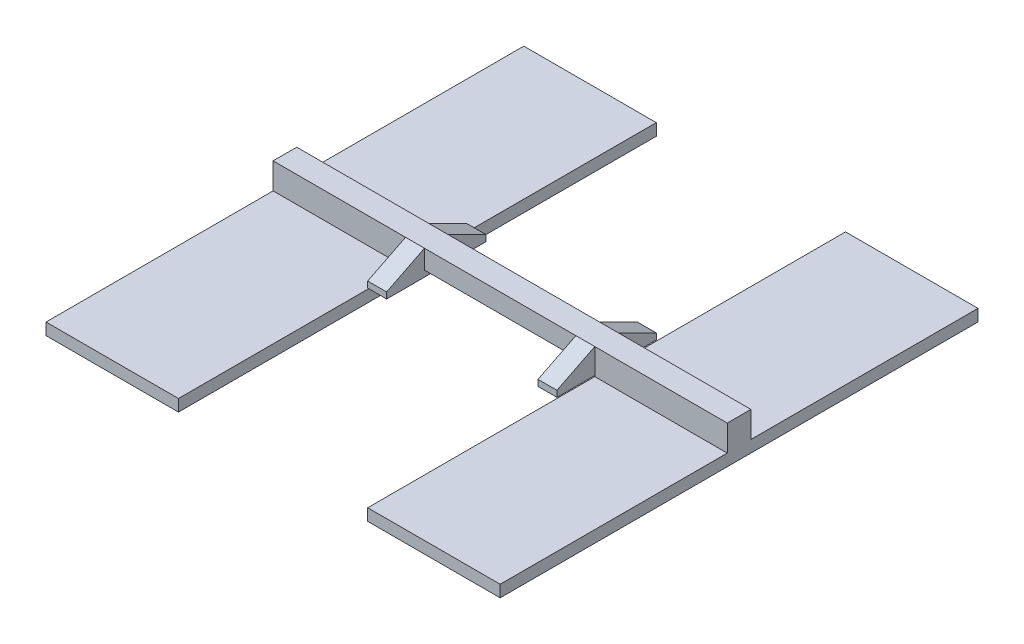
ISO-10303-21;
HEADER;
FILE_DESCRIPTION(('STEP AP214'),'2;1');
FILE_NAME('part.step','',(''),(''),'','','');
FILE_SCHEMA(('AUTOMOTIVE_DESIGN { 1 0 10303 214 1 1 1 1 }'));
ENDSEC;
DATA;
#1=APPLICATION_CONTEXT('core data for automotive mechanical design processes');
#2=APPLICATION_PROTOCOL_DEFINITION('international standard','automotive_design',2000,#1);
#3=PRODUCT_CONTEXT('',#1,'mechanical');
#4=PRODUCT('Part','Part','',(#3));
#5=PRODUCT_RELATED_PRODUCT_CATEGORY('part','',(#4));
#6=PRODUCT_DEFINITION_FORMATION('','',#4);
#7=PRODUCT_DEFINITION_CONTEXT('part definition',#1,'design');
#8=PRODUCT_DEFINITION('design','',#6,#7);
#9=PRODUCT_DEFINITION_SHAPE('','',#8);
#10=(LENGTH_UNIT() NAMED_UNIT(*) SI_UNIT(.MILLI.,.METRE.));
#11=(NAMED_UNIT(*) PLANE_ANGLE_UNIT() SI_UNIT($,.RADIAN.));
#12=(NAMED_UNIT(*) SI_UNIT($,.STERADIAN.) SOLID_ANGLE_UNIT());
#13=UNCERTAINTY_MEASURE_WITH_UNIT(LENGTH_MEASURE(1.E-05),#10,'distance_accuracy_value','');
#14=(GEOMETRIC_REPRESENTATION_CONTEXT(3) GLOBAL_UNCERTAINTY_ASSIGNED_CONTEXT((#13)) GLOBAL_UNIT_ASSIGNED_CONTEXT((#10,
#11,#12)) REPRESENTATION_CONTEXT('',''));
#15=CARTESIAN_POINT('',(0.,0.,0.));
#16=DIRECTION('',(0.,0.,1.));
#17=DIRECTION('',(1.,0.,0.));
#18=AXIS2_PLACEMENT_3D('',#15,#16,#17);
#19=CARTESIAN_POINT('',(0.,0.,1.25));
#20=DIRECTION('',(0.,0.,-1.));
#21=DIRECTION('',(-1.,0.,0.));
#22=AXIS2_PLACEMENT_3D('',#19,#20,#21);
#23=PLANE('',#22);
#24=DIRECTION('',(0.,-1.,0.));
#25=VECTOR('',#24,1.);
#26=CARTESIAN_POINT('',(1.,1.,1.25));
#27=LINE('',#26,#25);
#28=CARTESIAN_POINT('',(1.,1.,1.25));
#29=VERTEX_POINT('',#28);
#30=CARTESIAN_POINT('',(1.,0.,1.25));
#31=VERTEX_POINT('',#30);
#32=EDGE_CURVE('E359',#29,#31,#27,.T.);
#33=ORIENTED_EDGE('',*,*,#32,.T.);
#34=DIRECTION('',(1.,0.,0.));
#35=VECTOR('',#34,1.);
#36=CARTESIAN_POINT('',(1.,0.,1.25));
#37=LINE('',#36,#35);
#38=CARTESIAN_POINT('',(9.,0.,1.25));
#39=VERTEX_POINT('',#38);
#40=EDGE_CURVE('E517',#31,#39,#37,.T.);
#41=ORIENTED_EDGE('',*,*,#40,.T.);
#42=DIRECTION('',(0.,1.,0.));
#43=VECTOR('',#42,1.);
#44=CARTESIAN_POINT('',(9.,-0.325,1.25));
#45=LINE('',#44,#43);
#46=CARTESIAN_POINT('',(9.,1.,1.25));
#47=VERTEX_POINT('',#46);
#48=EDGE_CURVE('E399',#39,#47,#45,.T.);
#49=ORIENTED_EDGE('',*,*,#48,.T.);
#50=DIRECTION('',(-1.,0.,0.));
#51=VECTOR('',#50,1.);
#52=CARTESIAN_POINT('',(10.,1.,1.25));
#53=LINE('',#52,#51);
#54=EDGE_CURVE('E509',#47,#29,#53,.T.);
#55=ORIENTED_EDGE('',*,*,#54,.T.);
#56=EDGE_LOOP('',(#33,#41,#49,#55));
#57=FACE_BOUND('',#56,.T.);
#58=ADVANCED_FACE('F43',(#57),#23,.F.);
#59=CARTESIAN_POINT('',(0.,0.,0.));
#60=DIRECTION('',(0.,0.,-1.));
#61=DIRECTION('',(-1.,0.,0.));
#62=AXIS2_PLACEMENT_3D('',#59,#60,#61);
#63=PLANE('',#62);
#64=DIRECTION('',(1.,0.,0.));
#65=VECTOR('',#64,1.);
#66=CARTESIAN_POINT('',(1.,0.,0.));
#67=LINE('',#66,#65);
#68=CARTESIAN_POINT('',(1.,0.,0.));
#69=VERTEX_POINT('',#68);
#70=CARTESIAN_POINT('',(9.,0.,0.));
#71=VERTEX_POINT('',#70);
#72=EDGE_CURVE('E539',#69,#71,#67,.T.);
#73=ORIENTED_EDGE('',*,*,#72,.F.);
#74=DIRECTION('',(0.,1.,0.));
#75=VECTOR('',#74,1.);
#76=CARTESIAN_POINT('',(1.,0.999999999999999,0.));
#77=LINE('',#76,#75);
#78=CARTESIAN_POINT('',(1.,0.999999999999999,0.));
#79=VERTEX_POINT('',#78);
#80=EDGE_CURVE('E370',#69,#79,#77,.T.);
#81=ORIENTED_EDGE('',*,*,#80,.T.);
#82=DIRECTION('',(-1.,0.,0.));
#83=VECTOR('',#82,1.);
#84=CARTESIAN_POINT('',(0.,1.,0.));
#85=LINE('',#84,#83);
#86=CARTESIAN_POINT('',(9.,1.,0.));
#87=VERTEX_POINT('',#86);
#88=EDGE_CURVE('E532',#87,#79,#85,.T.);
#89=ORIENTED_EDGE('',*,*,#88,.F.);
#90=DIRECTION('',(0.,-1.,0.));
#91=VECTOR('',#90,1.);
#92=CARTESIAN_POINT('',(9.,1.,0.));
#93=LINE('',#92,#91);
#94=EDGE_CURVE('E388',#87,#71,#93,.T.);
#95=ORIENTED_EDGE('',*,*,#94,.T.);
#96=EDGE_LOOP('',(#73,#81,#89,#95));
#97=FACE_BOUND('',#96,.T.);
#98=ADVANCED_FACE('F627',(#97),#63,.T.);
#99=DIRECTION('',(1.,0.,0.));
#100=VECTOR('',#99,1.);
#101=CARTESIAN_POINT('',(0.,-0.375849035476877,0.));
#102=LINE('',#101,#100);
#103=CARTESIAN_POINT('',(10.,-0.375849035476877,0.));
#104=VERTEX_POINT('',#103);
#105=CARTESIAN_POINT('',(17.,-0.375849035476877,0.));
#106=VERTEX_POINT('',#105);
#107=EDGE_CURVE('E301',#104,#106,#102,.T.);
#108=ORIENTED_EDGE('',*,*,#107,.F.);
#109=DIRECTION('',(0.,-1.,0.));
#110=VECTOR('',#109,1.);
#111=CARTESIAN_POINT('',(10.,-0.325,0.));
#112=LINE('',#111,#110);
#113=CARTESIAN_POINT('',(10.,-0.325,0.));
#114=VERTEX_POINT('',#113);
#115=EDGE_CURVE('E543',#114,#104,#112,.T.);
#116=ORIENTED_EDGE('',*,*,#115,.F.);
#117=DIRECTION('',(0.,-1.,0.));
#118=VECTOR('',#117,1.);
#119=CARTESIAN_POINT('',(10.,-0.325,0.));
#120=LINE('',#119,#118);
#121=CARTESIAN_POINT('',(10.,1.,0.));
#122=VERTEX_POINT('',#121);
#123=EDGE_CURVE('E435',#122,#114,#120,.T.);
#124=ORIENTED_EDGE('',*,*,#123,.F.);
#125=CARTESIAN_POINT('',(17.,1.,0.));
#126=VERTEX_POINT('',#125);
#127=EDGE_CURVE('E527',#126,#122,#85,.T.);
#128=ORIENTED_EDGE('',*,*,#127,.F.);
#129=DIRECTION('',(0.,1.,0.));
#130=VECTOR('',#129,1.);
#131=CARTESIAN_POINT('',(17.,1.,0.));
#132=LINE('',#131,#130);
#133=EDGE_CURVE('E546',#106,#126,#132,.T.);
#134=ORIENTED_EDGE('',*,*,#133,.F.);
#135=EDGE_LOOP('',(#108,#116,#124,#128,#134));
#136=FACE_BOUND('',#135,.T.);
#137=ADVANCED_FACE('F634',(#136),#63,.T.);
#138=DIRECTION('',(0.,-1.,0.));
#139=VECTOR('',#138,1.);
#140=CARTESIAN_POINT('',(-7.,0.999999999999999,1.25));
#141=LINE('',#140,#139);
#142=CARTESIAN_POINT('',(-7.,0.999999999999999,1.25));
#143=VERTEX_POINT('',#142);
#144=CARTESIAN_POINT('',(-7.,-0.375849035476877,1.25));
#145=VERTEX_POINT('',#144);
#146=EDGE_CURVE('E508',#143,#145,#141,.T.);
#147=ORIENTED_EDGE('',*,*,#146,.T.);
#148=DIRECTION('',(1.,0.,0.));
#149=VECTOR('',#148,1.);
#150=CARTESIAN_POINT('',(0.,-0.375849035476877,1.25));
#151=LINE('',#150,#149);
#152=CARTESIAN_POINT('',(0.,-0.375849035476877,1.25));
#153=VERTEX_POINT('',#152);
#154=EDGE_CURVE('E350',#145,#153,#151,.T.);
#155=ORIENTED_EDGE('',*,*,#154,.T.);
#156=DIRECTION('',(0.,1.,0.));
#157=VECTOR('',#156,1.);
#158=CARTESIAN_POINT('',(0.,-0.325,1.25));
#159=LINE('',#158,#157);
#160=CARTESIAN_POINT('',(0.,-0.325,1.25));
#161=VERTEX_POINT('',#160);
#162=EDGE_CURVE('E514',#153,#161,#159,.T.);
#163=ORIENTED_EDGE('',*,*,#162,.T.);
#164=DIRECTION('',(0.,-1.,0.));
#165=VECTOR('',#164,1.);
#166=CARTESIAN_POINT('',(0.,-0.325,1.25));
#167=LINE('',#166,#165);
#168=CARTESIAN_POINT('',(0.,1.,1.25));
#169=VERTEX_POINT('',#168);
#170=EDGE_CURVE('E480',#169,#161,#167,.T.);
#171=ORIENTED_EDGE('',*,*,#170,.F.);
#172=EDGE_CURVE('E510',#169,#143,#53,.T.);
#173=ORIENTED_EDGE('',*,*,#172,.T.);
#174=EDGE_LOOP('',(#147,#155,#163,#171,#173));
#175=FACE_BOUND('',#174,.T.);
#176=ADVANCED_FACE('F603',(#175),#23,.F.);
#177=DIRECTION('',(1.,0.,0.));
#178=VECTOR('',#177,1.);
#179=CARTESIAN_POINT('',(0.,-0.375849035476877,0.));
#180=LINE('',#179,#178);
#181=CARTESIAN_POINT('',(-7.,-0.375849035476877,0.));
#182=VERTEX_POINT('',#181);
#183=CARTESIAN_POINT('',(0.,-0.375849035476877,0.));
#184=VERTEX_POINT('',#183);
#185=EDGE_CURVE('E341',#182,#184,#180,.T.);
#186=ORIENTED_EDGE('',*,*,#185,.F.);
#187=DIRECTION('',(0.,-1.,0.));
#188=VECTOR('',#187,1.);
#189=CARTESIAN_POINT('',(-7.,0.999999999999999,0.));
#190=LINE('',#189,#188);
#191=CARTESIAN_POINT('',(-7.,0.999999999999999,0.));
#192=VERTEX_POINT('',#191);
#193=EDGE_CURVE('E531',#192,#182,#190,.T.);
#194=ORIENTED_EDGE('',*,*,#193,.F.);
#195=CARTESIAN_POINT('',(0.,0.999999999999999,0.));
#196=VERTEX_POINT('',#195);
#197=EDGE_CURVE('E503',#196,#192,#85,.T.);
#198=ORIENTED_EDGE('',*,*,#197,.F.);
#199=DIRECTION('',(0.,1.,0.));
#200=VECTOR('',#199,1.);
#201=CARTESIAN_POINT('',(0.,-0.325,0.));
#202=LINE('',#201,#200);
#203=CARTESIAN_POINT('',(0.,-0.325,0.));
#204=VERTEX_POINT('',#203);
#205=EDGE_CURVE('E413',#204,#196,#202,.T.);
#206=ORIENTED_EDGE('',*,*,#205,.F.);
#207=DIRECTION('',(0.,1.,0.));
#208=VECTOR('',#207,1.);
#209=CARTESIAN_POINT('',(0.,-0.325,0.));
#210=LINE('',#209,#208);
#211=EDGE_CURVE('E536',#184,#204,#210,.T.);
#212=ORIENTED_EDGE('',*,*,#211,.F.);
#213=EDGE_LOOP('',(#186,#194,#198,#206,#212));
#214=FACE_BOUND('',#213,.T.);
#215=ADVANCED_FACE('F612',(#214),#63,.T.);
#216=DIRECTION('',(0.,-1.,0.));
#217=VECTOR('',#216,1.);
#218=CARTESIAN_POINT('',(10.,-0.325,1.25));
#219=LINE('',#218,#217);
#220=CARTESIAN_POINT('',(10.,-0.325,1.25));
#221=VERTEX_POINT('',#220);
#222=CARTESIAN_POINT('',(10.,-0.375849035476877,1.25));
#223=VERTEX_POINT('',#222);
#224=EDGE_CURVE('E59',#221,#223,#219,.T.);
#225=ORIENTED_EDGE('',*,*,#224,.T.);
#226=DIRECTION('',(1.,0.,0.));
#227=VECTOR('',#226,1.);
#228=CARTESIAN_POINT('',(0.,-0.375849035476877,1.25));
#229=LINE('',#228,#227);
#230=CARTESIAN_POINT('',(17.,-0.375849035476877,1.25));
#231=VERTEX_POINT('',#230);
#232=EDGE_CURVE('E63',#223,#231,#229,.T.);
#233=ORIENTED_EDGE('',*,*,#232,.T.);
#234=DIRECTION('',(0.,1.,0.));
#235=VECTOR('',#234,1.);
#236=CARTESIAN_POINT('',(17.,1.,1.25));
#237=LINE('',#236,#235);
#238=CARTESIAN_POINT('',(17.,1.,1.25));
#239=VERTEX_POINT('',#238);
#240=EDGE_CURVE('E523',#231,#239,#237,.T.);
#241=ORIENTED_EDGE('',*,*,#240,.T.);
#242=CARTESIAN_POINT('',(10.,1.,1.25));
#243=VERTEX_POINT('',#242);
#244=EDGE_CURVE('E504',#239,#243,#53,.T.);
#245=ORIENTED_EDGE('',*,*,#244,.T.);
#246=DIRECTION('',(0.,1.,0.));
#247=VECTOR('',#246,1.);
#248=CARTESIAN_POINT('',(10.,-0.325,1.25));
#249=LINE('',#248,#247);
#250=EDGE_CURVE('E458',#221,#243,#249,.T.);
#251=ORIENTED_EDGE('',*,*,#250,.F.);
#252=EDGE_LOOP('',(#225,#233,#241,#245,#251));
#253=FACE_BOUND('',#252,.T.);
#254=ADVANCED_FACE('F630',(#253),#23,.F.);
#255=CARTESIAN_POINT('',(0.,1.,1.25));
#256=DIRECTION('',(0.,-1.,0.));
#257=DIRECTION('',(1.,0.,0.));
#258=AXIS2_PLACEMENT_3D('',#255,#256,#257);
#259=PLANE('',#258);
#260=ORIENTED_EDGE('',*,*,#127,.T.);
#261=DIRECTION('',(1.,0.,0.));
#262=VECTOR('',#261,1.);
#263=CARTESIAN_POINT('',(9.,1.,0.));
#264=LINE('',#263,#262);
#265=EDGE_CURVE('E391',#87,#122,#264,.T.);
#266=ORIENTED_EDGE('',*,*,#265,.F.);
#267=ORIENTED_EDGE('',*,*,#88,.T.);
#268=DIRECTION('',(-1.,0.,0.));
#269=VECTOR('',#268,1.);
#270=CARTESIAN_POINT('',(1.,0.999999999999999,0.));
#271=LINE('',#270,#269);
#272=EDGE_CURVE('E377',#79,#196,#271,.T.);
#273=ORIENTED_EDGE('',*,*,#272,.T.);
#274=ORIENTED_EDGE('',*,*,#197,.T.);
#275=DIRECTION('',(0.,0.,-1.));
#276=VECTOR('',#275,1.);
#277=CARTESIAN_POINT('',(-7.,0.999999999999999,1.25));
#278=LINE('',#277,#276);
#279=EDGE_CURVE('E11',#143,#192,#278,.T.);
#280=ORIENTED_EDGE('',*,*,#279,.F.);
#281=ORIENTED_EDGE('',*,*,#172,.F.);
#282=DIRECTION('',(-1.,0.,0.));
#283=VECTOR('',#282,1.);
#284=CARTESIAN_POINT('',(1.,1.,1.25));
#285=LINE('',#284,#283);
#286=EDGE_CURVE('E362',#29,#169,#285,.T.);
#287=ORIENTED_EDGE('',*,*,#286,.F.);
#288=ORIENTED_EDGE('',*,*,#54,.F.);
#289=DIRECTION('',(1.,0.,0.));
#290=VECTOR('',#289,1.);
#291=CARTESIAN_POINT('',(9.,1.,1.25));
#292=LINE('',#291,#290);
#293=EDGE_CURVE('E406',#47,#243,#292,.T.);
#294=ORIENTED_EDGE('',*,*,#293,.T.);
#295=ORIENTED_EDGE('',*,*,#244,.F.);
#296=DIRECTION('',(0.,0.,-1.));
#297=VECTOR('',#296,1.);
#298=CARTESIAN_POINT('',(17.,1.,1.25));
#299=LINE('',#298,#297);
#300=EDGE_CURVE('E526',#239,#126,#299,.T.);
#301=ORIENTED_EDGE('',*,*,#300,.T.);
#302=EDGE_LOOP('',(#260,#266,#267,#273,#274,#280,#281,#287,#288,#294,#295,#301));
#303=FACE_BOUND('',#302,.T.);
#304=ADVANCED_FACE('F45',(#303),#259,.F.);
#305=CARTESIAN_POINT('',(-7.,0.999999999999999,1.25));
#306=DIRECTION('',(1.,0.,0.));
#307=DIRECTION('',(0.,1.,0.));
#308=AXIS2_PLACEMENT_3D('',#305,#306,#307);
#309=PLANE('',#308);
#310=ORIENTED_EDGE('',*,*,#193,.T.);
#311=DIRECTION('',(0.,0.,1.));
#312=VECTOR('',#311,1.);
#313=CARTESIAN_POINT('',(-7.,-0.375849035476877,-12.));
#314=LINE('',#313,#312);
#315=CARTESIAN_POINT('',(-7.,-0.375849035476877,-12.));
#316=VERTEX_POINT('',#315);
#317=EDGE_CURVE('E337',#316,#182,#314,.T.);
#318=ORIENTED_EDGE('',*,*,#317,.F.);
#319=DIRECTION('',(0.,-1.,0.));
#320=VECTOR('',#319,1.);
#321=CARTESIAN_POINT('',(-7.,-1.,-12.));
#322=LINE('',#321,#320);
#323=CARTESIAN_POINT('',(-7.,-1.,-12.));
#324=VERTEX_POINT('',#323);
#325=EDGE_CURVE('E328',#316,#324,#322,.T.);
#326=ORIENTED_EDGE('',*,*,#325,.T.);
#327=DIRECTION('',(0.,0.,-1.));
#328=VECTOR('',#327,1.);
#329=CARTESIAN_POINT('',(-7.,-1.,1.25));
#330=LINE('',#329,#328);
#331=CARTESIAN_POINT('',(-7.,-1.,13.25));
#332=VERTEX_POINT('',#331);
#333=EDGE_CURVE('E52',#332,#324,#330,.T.);
#334=ORIENTED_EDGE('',*,*,#333,.F.);
#335=DIRECTION('',(0.,-1.,0.));
#336=VECTOR('',#335,1.);
#337=CARTESIAN_POINT('',(-7.,-1.,13.25));
#338=LINE('',#337,#336);
#339=CARTESIAN_POINT('',(-7.,-0.375849035476877,13.25));
#340=VERTEX_POINT('',#339);
#341=EDGE_CURVE('E312',#340,#332,#338,.T.);
#342=ORIENTED_EDGE('',*,*,#341,.F.);
#343=EDGE_CURVE('E342',#145,#340,#314,.T.);
#344=ORIENTED_EDGE('',*,*,#343,.F.);
#345=ORIENTED_EDGE('',*,*,#146,.F.);
#346=ORIENTED_EDGE('',*,*,#279,.T.);
#347=EDGE_LOOP('',(#310,#318,#326,#334,#342,#344,#345,#346));
#348=FACE_BOUND('',#347,.T.);
#349=ADVANCED_FACE('F586',(#348),#309,.F.);
#350=CARTESIAN_POINT('',(0.,-1.,1.25));
#351=DIRECTION('',(0.,1.,0.));
#352=DIRECTION('',(-1.,0.,0.));
#353=AXIS2_PLACEMENT_3D('',#350,#351,#352);
#354=PLANE('',#353);
#355=ORIENTED_EDGE('',*,*,#333,.T.);
#356=DIRECTION('',(1.,0.,0.));
#357=VECTOR('',#356,1.);
#358=CARTESIAN_POINT('',(0.,-1.,-12.));
#359=LINE('',#358,#357);
#360=CARTESIAN_POINT('',(0.,-1.,-12.));
#361=VERTEX_POINT('',#360);
#362=EDGE_CURVE('E332',#324,#361,#359,.T.);
#363=ORIENTED_EDGE('',*,*,#362,.T.);
#364=DIRECTION('',(0.,0.,-1.));
#365=VECTOR('',#364,1.);
#366=CARTESIAN_POINT('',(0.,-1.,1.25));
#367=LINE('',#366,#365);
#368=CARTESIAN_POINT('',(0.,-1.,13.25));
#369=VERTEX_POINT('',#368);
#370=EDGE_CURVE('E574',#369,#361,#367,.T.);
#371=ORIENTED_EDGE('',*,*,#370,.F.);
#372=DIRECTION('',(1.,0.,0.));
#373=VECTOR('',#372,1.);
#374=CARTESIAN_POINT('',(0.,-1.,13.25));
#375=LINE('',#374,#373);
#376=EDGE_CURVE('E316',#332,#369,#375,.T.);
#377=ORIENTED_EDGE('',*,*,#376,.F.);
#378=EDGE_LOOP('',(#355,#363,#371,#377));
#379=FACE_BOUND('',#378,.T.);
#380=ADVANCED_FACE('F581',(#379),#354,.F.);
#381=CARTESIAN_POINT('',(0.,-0.325,1.25));
#382=DIRECTION('',(-1.,0.,0.));
#383=DIRECTION('',(0.,-1.,0.));
#384=AXIS2_PLACEMENT_3D('',#381,#382,#383);
#385=PLANE('',#384);
#386=ORIENTED_EDGE('',*,*,#162,.F.);
#387=DIRECTION('',(0.,0.,1.));
#388=VECTOR('',#387,1.);
#389=CARTESIAN_POINT('',(0.,-0.375849035476877,-12.));
#390=LINE('',#389,#388);
#391=CARTESIAN_POINT('',(0.,-0.375849035476877,13.25));
#392=VERTEX_POINT('',#391);
#393=EDGE_CURVE('E336',#153,#392,#390,.T.);
#394=ORIENTED_EDGE('',*,*,#393,.T.);
#395=DIRECTION('',(0.,1.,0.));
#396=VECTOR('',#395,1.);
#397=CARTESIAN_POINT('',(0.,-1.,13.25));
#398=LINE('',#397,#396);
#399=EDGE_CURVE('E304',#369,#392,#398,.T.);
#400=ORIENTED_EDGE('',*,*,#399,.F.);
#401=ORIENTED_EDGE('',*,*,#370,.T.);
#402=DIRECTION('',(0.,1.,0.));
#403=VECTOR('',#402,1.);
#404=CARTESIAN_POINT('',(0.,-1.,-12.));
#405=LINE('',#404,#403);
#406=CARTESIAN_POINT('',(0.,-0.375849035476877,-12.));
#407=VERTEX_POINT('',#406);
#408=EDGE_CURVE('E320',#361,#407,#405,.T.);
#409=ORIENTED_EDGE('',*,*,#408,.T.);
#410=EDGE_CURVE('E343',#407,#184,#390,.T.);
#411=ORIENTED_EDGE('',*,*,#410,.T.);
#412=ORIENTED_EDGE('',*,*,#211,.T.);
#413=DIRECTION('',(0.,0.,-1.));
#414=VECTOR('',#413,1.);
#415=CARTESIAN_POINT('',(0.,-0.325,1.25));
#416=LINE('',#415,#414);
#417=EDGE_CURVE('E570',#161,#204,#416,.T.);
#418=ORIENTED_EDGE('',*,*,#417,.F.);
#419=EDGE_LOOP('',(#386,#394,#400,#401,#409,#411,#412,#418));
#420=FACE_BOUND('',#419,.T.);
#421=ADVANCED_FACE('F593',(#420),#385,.F.);
#422=CARTESIAN_POINT('',(0.,-0.325,1.25));
#423=DIRECTION('',(0.,1.,0.));
#424=DIRECTION('',(0.,0.,1.));
#425=AXIS2_PLACEMENT_3D('',#422,#423,#424);
#426=PLANE('',#425);
#427=ORIENTED_EDGE('',*,*,#417,.T.);
#428=DIRECTION('',(0.,0.,1.));
#429=VECTOR('',#428,1.);
#430=CARTESIAN_POINT('',(0.,-0.325,-2.));
#431=LINE('',#430,#429);
#432=CARTESIAN_POINT('',(0.,-0.325,-2.));
#433=VERTEX_POINT('',#432);
#434=EDGE_CURVE('E429',#433,#204,#431,.T.);
#435=ORIENTED_EDGE('',*,*,#434,.F.);
#436=DIRECTION('',(-1.,0.,0.));
#437=VECTOR('',#436,1.);
#438=CARTESIAN_POINT('',(1.,-0.325,-2.));
#439=LINE('',#438,#437);
#440=CARTESIAN_POINT('',(1.,-0.325,-2.));
#441=VERTEX_POINT('',#440);
#442=EDGE_CURVE('E418',#441,#433,#439,.T.);
#443=ORIENTED_EDGE('',*,*,#442,.F.);
#444=DIRECTION('',(0.,0.,-1.));
#445=VECTOR('',#444,1.);
#446=CARTESIAN_POINT('',(1.,-0.325,1.25));
#447=LINE('',#446,#445);
#448=CARTESIAN_POINT('',(1.,-0.325,3.25));
#449=VERTEX_POINT('',#448);
#450=EDGE_CURVE('E567',#449,#441,#447,.T.);
#451=ORIENTED_EDGE('',*,*,#450,.F.);
#452=DIRECTION('',(1.,0.,0.));
#453=VECTOR('',#452,1.);
#454=CARTESIAN_POINT('',(1.,-0.325,3.25));
#455=LINE('',#454,#453);
#456=CARTESIAN_POINT('',(0.,-0.325,3.25));
#457=VERTEX_POINT('',#456);
#458=EDGE_CURVE('E492',#457,#449,#455,.T.);
#459=ORIENTED_EDGE('',*,*,#458,.F.);
#460=DIRECTION('',(0.,0.,-1.));
#461=VECTOR('',#460,1.);
#462=CARTESIAN_POINT('',(0.,-0.325,3.25));
#463=LINE('',#462,#461);
#464=EDGE_CURVE('E496',#457,#161,#463,.T.);
#465=ORIENTED_EDGE('',*,*,#464,.T.);
#466=EDGE_LOOP('',(#427,#435,#443,#451,#459,#465));
#467=FACE_BOUND('',#466,.T.);
#468=ADVANCED_FACE('F977',(#467),#426,.F.);
#469=CARTESIAN_POINT('',(1.,0.,1.25));
#470=DIRECTION('',(-1.,0.,0.));
#471=DIRECTION('',(0.,0.,1.));
#472=AXIS2_PLACEMENT_3D('',#469,#470,#471);
#473=PLANE('',#472);
#474=ORIENTED_EDGE('',*,*,#450,.T.);
#475=DIRECTION('',(0.,-1.,0.));
#476=VECTOR('',#475,1.);
#477=CARTESIAN_POINT('',(1.,-0.325,-2.));
#478=LINE('',#477,#476);
#479=CARTESIAN_POINT('',(1.,0.,-2.));
#480=VERTEX_POINT('',#479);
#481=EDGE_CURVE('E414',#480,#441,#478,.T.);
#482=ORIENTED_EDGE('',*,*,#481,.F.);
#483=DIRECTION('',(0.,-0.447213595499958,-0.894427190999916));
#484=VECTOR('',#483,1.);
#485=CARTESIAN_POINT('',(1.,0.,-2.));
#486=LINE('',#485,#484);
#487=EDGE_CURVE('E374',#79,#480,#486,.T.);
#488=ORIENTED_EDGE('',*,*,#487,.F.);
#489=ORIENTED_EDGE('',*,*,#80,.F.);
#490=DIRECTION('',(0.,0.,-1.));
#491=VECTOR('',#490,1.);
#492=CARTESIAN_POINT('',(1.,0.,1.25));
#493=LINE('',#492,#491);
#494=EDGE_CURVE('E563',#31,#69,#493,.T.);
#495=ORIENTED_EDGE('',*,*,#494,.F.);
#496=ORIENTED_EDGE('',*,*,#32,.F.);
#497=DIRECTION('',(0.,0.447213595499958,-0.894427190999916));
#498=VECTOR('',#497,1.);
#499=CARTESIAN_POINT('',(1.,0.,3.25));
#500=LINE('',#499,#498);
#501=CARTESIAN_POINT('',(1.,0.,3.25));
#502=VERTEX_POINT('',#501);
#503=EDGE_CURVE('E355',#502,#29,#500,.T.);
#504=ORIENTED_EDGE('',*,*,#503,.F.);
#505=DIRECTION('',(0.,1.,0.));
#506=VECTOR('',#505,1.);
#507=CARTESIAN_POINT('',(1.,-0.325,3.25));
#508=LINE('',#507,#506);
#509=EDGE_CURVE('E481',#449,#502,#508,.T.);
#510=ORIENTED_EDGE('',*,*,#509,.F.);
#511=EDGE_LOOP('',(#474,#482,#488,#489,#495,#496,#504,#510));
#512=FACE_BOUND('',#511,.T.);
#513=ADVANCED_FACE('F922',(#512),#473,.F.);
#514=CARTESIAN_POINT('',(1.,0.,1.25));
#515=DIRECTION('',(0.,1.,0.));
#516=DIRECTION('',(-1.,0.,0.));
#517=AXIS2_PLACEMENT_3D('',#514,#515,#516);
#518=PLANE('',#517);
#519=ORIENTED_EDGE('',*,*,#72,.T.);
#520=DIRECTION('',(0.,0.,-1.));
#521=VECTOR('',#520,1.);
#522=CARTESIAN_POINT('',(9.,0.,1.25));
#523=LINE('',#522,#521);
#524=EDGE_CURVE('E559',#39,#71,#523,.T.);
#525=ORIENTED_EDGE('',*,*,#524,.F.);
#526=ORIENTED_EDGE('',*,*,#40,.F.);
#527=ORIENTED_EDGE('',*,*,#494,.T.);
#528=EDGE_LOOP('',(#519,#525,#526,#527));
#529=FACE_BOUND('',#528,.T.);
#530=ADVANCED_FACE('F928',(#529),#518,.F.);
#531=CARTESIAN_POINT('',(9.,0.,1.25));
#532=DIRECTION('',(1.,0.,0.));
#533=DIRECTION('',(0.,0.,-1.));
#534=AXIS2_PLACEMENT_3D('',#531,#532,#533);
#535=PLANE('',#534);
#536=DIRECTION('',(0.,1.,0.));
#537=VECTOR('',#536,1.);
#538=CARTESIAN_POINT('',(9.,-0.325,-2.));
#539=LINE('',#538,#537);
#540=CARTESIAN_POINT('',(9.,-0.325,-2.));
#541=VERTEX_POINT('',#540);
#542=CARTESIAN_POINT('',(9.,0.,-2.));
#543=VERTEX_POINT('',#542);
#544=EDGE_CURVE('E436',#541,#543,#539,.T.);
#545=ORIENTED_EDGE('',*,*,#544,.F.);
#546=DIRECTION('',(0.,0.,-1.));
#547=VECTOR('',#546,1.);
#548=CARTESIAN_POINT('',(9.,-0.325,1.25));
#549=LINE('',#548,#547);
#550=CARTESIAN_POINT('',(9.,-0.325,3.25));
#551=VERTEX_POINT('',#550);
#552=EDGE_CURVE('E556',#551,#541,#549,.T.);
#553=ORIENTED_EDGE('',*,*,#552,.F.);
#554=DIRECTION('',(0.,-1.,0.));
#555=VECTOR('',#554,1.);
#556=CARTESIAN_POINT('',(9.,-0.325,3.25));
#557=LINE('',#556,#555);
#558=CARTESIAN_POINT('',(9.,0.,3.25));
#559=VERTEX_POINT('',#558);
#560=EDGE_CURVE('E459',#559,#551,#557,.T.);
#561=ORIENTED_EDGE('',*,*,#560,.F.);
#562=DIRECTION('',(0.,-0.447213595499958,0.894427190999916));
#563=VECTOR('',#562,1.);
#564=CARTESIAN_POINT('',(9.,0.,3.25));
#565=LINE('',#564,#563);
#566=EDGE_CURVE('E403',#47,#559,#565,.T.);
#567=ORIENTED_EDGE('',*,*,#566,.F.);
#568=ORIENTED_EDGE('',*,*,#48,.F.);
#569=ORIENTED_EDGE('',*,*,#524,.T.);
#570=ORIENTED_EDGE('',*,*,#94,.F.);
#571=DIRECTION('',(0.,0.447213595499958,0.894427190999916));
#572=VECTOR('',#571,1.);
#573=CARTESIAN_POINT('',(9.,0.,-2.));
#574=LINE('',#573,#572);
#575=EDGE_CURVE('E385',#543,#87,#574,.T.);
#576=ORIENTED_EDGE('',*,*,#575,.F.);
#577=EDGE_LOOP('',(#545,#553,#561,#567,#568,#569,#570,#576));
#578=FACE_BOUND('',#577,.T.);
#579=ADVANCED_FACE('F677',(#578),#535,.F.);
#580=CARTESIAN_POINT('',(10.,-0.325,1.25));
#581=DIRECTION('',(0.,1.,0.));
#582=DIRECTION('',(-1.,0.,0.));
#583=AXIS2_PLACEMENT_3D('',#580,#581,#582);
#584=PLANE('',#583);
#585=DIRECTION('',(0.,0.,-1.));
#586=VECTOR('',#585,1.);
#587=CARTESIAN_POINT('',(10.,-0.325,1.25));
#588=LINE('',#587,#586);
#589=EDGE_CURVE('E252',#221,#114,#588,.T.);
#590=ORIENTED_EDGE('',*,*,#589,.F.);
#591=DIRECTION('',(0.,0.,-1.));
#592=VECTOR('',#591,1.);
#593=CARTESIAN_POINT('',(10.,-0.325,3.25));
#594=LINE('',#593,#592);
#595=CARTESIAN_POINT('',(10.,-0.325,3.25));
#596=VERTEX_POINT('',#595);
#597=EDGE_CURVE('E474',#596,#221,#594,.T.);
#598=ORIENTED_EDGE('',*,*,#597,.F.);
#599=DIRECTION('',(1.,0.,0.));
#600=VECTOR('',#599,1.);
#601=CARTESIAN_POINT('',(9.,-0.325,3.25));
#602=LINE('',#601,#600);
#603=EDGE_CURVE('E463',#551,#596,#602,.T.);
#604=ORIENTED_EDGE('',*,*,#603,.F.);
#605=ORIENTED_EDGE('',*,*,#552,.T.);
#606=DIRECTION('',(-1.,0.,0.));
#607=VECTOR('',#606,1.);
#608=CARTESIAN_POINT('',(9.,-0.325,-2.));
#609=LINE('',#608,#607);
#610=CARTESIAN_POINT('',(10.,-0.325,-2.));
#611=VERTEX_POINT('',#610);
#612=EDGE_CURVE('E447',#611,#541,#609,.T.);
#613=ORIENTED_EDGE('',*,*,#612,.F.);
#614=DIRECTION('',(0.,0.,1.));
#615=VECTOR('',#614,1.);
#616=CARTESIAN_POINT('',(10.,-0.325,-2.));
#617=LINE('',#616,#615);
#618=EDGE_CURVE('E451',#611,#114,#617,.T.);
#619=ORIENTED_EDGE('',*,*,#618,.T.);
#620=EDGE_LOOP('',(#590,#598,#604,#605,#613,#619));
#621=FACE_BOUND('',#620,.T.);
#622=ADVANCED_FACE('F659',(#621),#584,.F.);
#623=CARTESIAN_POINT('',(10.,-0.325,1.25));
#624=DIRECTION('',(1.,0.,0.));
#625=DIRECTION('',(0.,0.,-1.));
#626=AXIS2_PLACEMENT_3D('',#623,#624,#625);
#627=PLANE('',#626);
#628=ORIENTED_EDGE('',*,*,#115,.T.);
#629=DIRECTION('',(0.,0.,1.));
#630=VECTOR('',#629,1.);
#631=CARTESIAN_POINT('',(10.,-0.375849035476877,-12.));
#632=LINE('',#631,#630);
#633=CARTESIAN_POINT('',(10.,-0.375849035476877,-12.));
#634=VERTEX_POINT('',#633);
#635=EDGE_CURVE('E291',#634,#104,#632,.T.);
#636=ORIENTED_EDGE('',*,*,#635,.F.);
#637=DIRECTION('',(0.,-1.,0.));
#638=VECTOR('',#637,1.);
#639=CARTESIAN_POINT('',(10.,-1.,-12.));
#640=LINE('',#639,#638);
#641=CARTESIAN_POINT('',(10.,-1.,-12.));
#642=VERTEX_POINT('',#641);
#643=EDGE_CURVE('E247',#634,#642,#640,.T.);
#644=ORIENTED_EDGE('',*,*,#643,.T.);
#645=DIRECTION('',(0.,0.,-1.));
#646=VECTOR('',#645,1.);
#647=CARTESIAN_POINT('',(10.,-1.,1.25));
#648=LINE('',#647,#646);
#649=CARTESIAN_POINT('',(10.,-1.,13.25));
#650=VERTEX_POINT('',#649);
#651=EDGE_CURVE('E239',#650,#642,#648,.T.);
#652=ORIENTED_EDGE('',*,*,#651,.F.);
#653=DIRECTION('',(0.,-1.,0.));
#654=VECTOR('',#653,1.);
#655=CARTESIAN_POINT('',(10.,-1.,13.25));
#656=LINE('',#655,#654);
#657=CARTESIAN_POINT('',(10.,-0.375849035476877,13.25));
#658=VERTEX_POINT('',#657);
#659=EDGE_CURVE('E245',#658,#650,#656,.T.);
#660=ORIENTED_EDGE('',*,*,#659,.F.);
#661=EDGE_CURVE('E294',#223,#658,#632,.T.);
#662=ORIENTED_EDGE('',*,*,#661,.F.);
#663=ORIENTED_EDGE('',*,*,#224,.F.);
#664=ORIENTED_EDGE('',*,*,#589,.T.);
#665=EDGE_LOOP('',(#628,#636,#644,#652,#660,#662,#663,#664));
#666=FACE_BOUND('',#665,.T.);
#667=ADVANCED_FACE('F242',(#666),#627,.F.);
#668=CARTESIAN_POINT('',(10.,-1.,1.25));
#669=DIRECTION('',(0.,1.,0.));
#670=DIRECTION('',(0.,0.,1.));
#671=AXIS2_PLACEMENT_3D('',#668,#669,#670);
#672=PLANE('',#671);
#673=ORIENTED_EDGE('',*,*,#651,.T.);
#674=DIRECTION('',(1.,0.,0.));
#675=VECTOR('',#674,1.);
#676=CARTESIAN_POINT('',(10.,-1.,-12.));
#677=LINE('',#676,#675);
#678=CARTESIAN_POINT('',(17.,-1.,-12.));
#679=VERTEX_POINT('',#678);
#680=EDGE_CURVE('E279',#642,#679,#677,.T.);
#681=ORIENTED_EDGE('',*,*,#680,.T.);
#682=DIRECTION('',(0.,0.,-1.));
#683=VECTOR('',#682,1.);
#684=CARTESIAN_POINT('',(17.,-1.,1.25));
#685=LINE('',#684,#683);
#686=CARTESIAN_POINT('',(17.,-1.,13.25));
#687=VERTEX_POINT('',#686);
#688=EDGE_CURVE('E253',#687,#679,#685,.T.);
#689=ORIENTED_EDGE('',*,*,#688,.F.);
#690=DIRECTION('',(1.,0.,0.));
#691=VECTOR('',#690,1.);
#692=CARTESIAN_POINT('',(10.,-1.,13.25));
#693=LINE('',#692,#691);
#694=EDGE_CURVE('E256',#650,#687,#693,.T.);
#695=ORIENTED_EDGE('',*,*,#694,.F.);
#696=EDGE_LOOP('',(#673,#681,#689,#695));
#697=FACE_BOUND('',#696,.T.);
#698=ADVANCED_FACE('F257',(#697),#672,.F.);
#699=CARTESIAN_POINT('',(17.,1.,1.25));
#700=DIRECTION('',(-1.,0.,0.));
#701=DIRECTION('',(0.,0.,1.));
#702=AXIS2_PLACEMENT_3D('',#699,#700,#701);
#703=PLANE('',#702);
#704=ORIENTED_EDGE('',*,*,#240,.F.);
#705=DIRECTION('',(0.,0.,1.));
#706=VECTOR('',#705,1.);
#707=CARTESIAN_POINT('',(17.,-0.375849035476877,-12.));
#708=LINE('',#707,#706);
#709=CARTESIAN_POINT('',(17.,-0.375849035476877,13.25));
#710=VERTEX_POINT('',#709);
#711=EDGE_CURVE('E290',#231,#710,#708,.T.);
#712=ORIENTED_EDGE('',*,*,#711,.T.);
#713=DIRECTION('',(0.,1.,0.));
#714=VECTOR('',#713,1.);
#715=CARTESIAN_POINT('',(17.,-1.,13.25));
#716=LINE('',#715,#714);
#717=EDGE_CURVE('E262',#687,#710,#716,.T.);
#718=ORIENTED_EDGE('',*,*,#717,.F.);
#719=ORIENTED_EDGE('',*,*,#688,.T.);
#720=DIRECTION('',(0.,1.,0.));
#721=VECTOR('',#720,1.);
#722=CARTESIAN_POINT('',(17.,-1.,-12.));
#723=LINE('',#722,#721);
#724=CARTESIAN_POINT('',(17.,-0.375849035476877,-12.));
#725=VERTEX_POINT('',#724);
#726=EDGE_CURVE('E282',#679,#725,#723,.T.);
#727=ORIENTED_EDGE('',*,*,#726,.T.);
#728=EDGE_CURVE('E295',#725,#106,#708,.T.);
#729=ORIENTED_EDGE('',*,*,#728,.T.);
#730=ORIENTED_EDGE('',*,*,#133,.T.);
#731=ORIENTED_EDGE('',*,*,#300,.F.);
#732=EDGE_LOOP('',(#704,#712,#718,#719,#727,#729,#730,#731));
#733=FACE_BOUND('',#732,.T.);
#734=ADVANCED_FACE('F687',(#733),#703,.F.);
#735=CARTESIAN_POINT('',(0.,-0.325,3.25));
#736=DIRECTION('',(1.,0.,0.));
#737=DIRECTION('',(0.,0.,-1.));
#738=AXIS2_PLACEMENT_3D('',#735,#736,#737);
#739=PLANE('',#738);
#740=ORIENTED_EDGE('',*,*,#170,.T.);
#741=ORIENTED_EDGE('',*,*,#464,.F.);
#742=DIRECTION('',(0.,-1.,0.));
#743=VECTOR('',#742,1.);
#744=CARTESIAN_POINT('',(0.,-0.325,3.25));
#745=LINE('',#744,#743);
#746=CARTESIAN_POINT('',(0.,0.,3.25));
#747=VERTEX_POINT('',#746);
#748=EDGE_CURVE('E489',#747,#457,#745,.T.);
#749=ORIENTED_EDGE('',*,*,#748,.F.);
#750=DIRECTION('',(0.,0.447213595499958,-0.894427190999916));
#751=VECTOR('',#750,1.);
#752=CARTESIAN_POINT('',(0.,0.,3.25));
#753=LINE('',#752,#751);
#754=EDGE_CURVE('E354',#747,#169,#753,.T.);
#755=ORIENTED_EDGE('',*,*,#754,.T.);
#756=EDGE_LOOP('',(#740,#741,#749,#755));
#757=FACE_BOUND('',#756,.T.);
#758=ADVANCED_FACE('F915',(#757),#739,.F.);
#759=CARTESIAN_POINT('',(0.,0.,3.25));
#760=DIRECTION('',(0.,0.,1.));
#761=DIRECTION('',(1.,0.,0.));
#762=AXIS2_PLACEMENT_3D('',#759,#760,#761);
#763=PLANE('',#762);
#764=ORIENTED_EDGE('',*,*,#509,.T.);
#765=DIRECTION('',(-1.,0.,0.));
#766=VECTOR('',#765,1.);
#767=CARTESIAN_POINT('',(1.,0.,3.25));
#768=LINE('',#767,#766);
#769=EDGE_CURVE('E485',#502,#747,#768,.T.);
#770=ORIENTED_EDGE('',*,*,#769,.T.);
#771=ORIENTED_EDGE('',*,*,#748,.T.);
#772=ORIENTED_EDGE('',*,*,#458,.T.);
#773=EDGE_LOOP('',(#764,#770,#771,#772));
#774=FACE_BOUND('',#773,.T.);
#775=ADVANCED_FACE('F919',(#774),#763,.T.);
#776=CARTESIAN_POINT('',(10.,-0.325,3.25));
#777=DIRECTION('',(-1.,0.,0.));
#778=DIRECTION('',(0.,0.,1.));
#779=AXIS2_PLACEMENT_3D('',#776,#777,#778);
#780=PLANE('',#779);
#781=ORIENTED_EDGE('',*,*,#250,.T.);
#782=DIRECTION('',(0.,-0.447213595499958,0.894427190999916));
#783=VECTOR('',#782,1.);
#784=CARTESIAN_POINT('',(10.,0.,3.25));
#785=LINE('',#784,#783);
#786=CARTESIAN_POINT('',(10.,0.,3.25));
#787=VERTEX_POINT('',#786);
#788=EDGE_CURVE('E398',#243,#787,#785,.T.);
#789=ORIENTED_EDGE('',*,*,#788,.T.);
#790=DIRECTION('',(0.,1.,0.));
#791=VECTOR('',#790,1.);
#792=CARTESIAN_POINT('',(10.,-0.325,3.25));
#793=LINE('',#792,#791);
#794=EDGE_CURVE('E466',#596,#787,#793,.T.);
#795=ORIENTED_EDGE('',*,*,#794,.F.);
#796=ORIENTED_EDGE('',*,*,#597,.T.);
#797=EDGE_LOOP('',(#781,#789,#795,#796));
#798=FACE_BOUND('',#797,.T.);
#799=ADVANCED_FACE('F667',(#798),#780,.F.);
#800=CARTESIAN_POINT('',(0.,0.,3.25));
#801=DIRECTION('',(0.,0.,-1.));
#802=DIRECTION('',(-1.,0.,0.));
#803=AXIS2_PLACEMENT_3D('',#800,#801,#802);
#804=PLANE('',#803);
#805=ORIENTED_EDGE('',*,*,#560,.T.);
#806=ORIENTED_EDGE('',*,*,#603,.T.);
#807=ORIENTED_EDGE('',*,*,#794,.T.);
#808=DIRECTION('',(-1.,0.,0.));
#809=VECTOR('',#808,1.);
#810=CARTESIAN_POINT('',(9.,0.,3.25));
#811=LINE('',#810,#809);
#812=EDGE_CURVE('E470',#787,#559,#811,.T.);
#813=ORIENTED_EDGE('',*,*,#812,.T.);
#814=EDGE_LOOP('',(#805,#806,#807,#813));
#815=FACE_BOUND('',#814,.T.);
#816=ADVANCED_FACE('F669',(#815),#804,.F.);
#817=CARTESIAN_POINT('',(10.,-0.325,-2.));
#818=DIRECTION('',(-1.,0.,0.));
#819=DIRECTION('',(0.,0.,1.));
#820=AXIS2_PLACEMENT_3D('',#817,#818,#819);
#821=PLANE('',#820);
#822=ORIENTED_EDGE('',*,*,#123,.T.);
#823=ORIENTED_EDGE('',*,*,#618,.F.);
#824=DIRECTION('',(0.,-1.,0.));
#825=VECTOR('',#824,1.);
#826=CARTESIAN_POINT('',(10.,-0.325,-2.));
#827=LINE('',#826,#825);
#828=CARTESIAN_POINT('',(10.,0.,-2.));
#829=VERTEX_POINT('',#828);
#830=EDGE_CURVE('E444',#829,#611,#827,.T.);
#831=ORIENTED_EDGE('',*,*,#830,.F.);
#832=DIRECTION('',(0.,0.447213595499958,0.894427190999916));
#833=VECTOR('',#832,1.);
#834=CARTESIAN_POINT('',(10.,0.,-2.));
#835=LINE('',#834,#833);
#836=EDGE_CURVE('E384',#829,#122,#835,.T.);
#837=ORIENTED_EDGE('',*,*,#836,.T.);
#838=EDGE_LOOP('',(#822,#823,#831,#837));
#839=FACE_BOUND('',#838,.T.);
#840=ADVANCED_FACE('F684',(#839),#821,.F.);
#841=CARTESIAN_POINT('',(0.,0.,-2.));
#842=DIRECTION('',(0.,0.,-1.));
#843=DIRECTION('',(-1.,0.,0.));
#844=AXIS2_PLACEMENT_3D('',#841,#842,#843);
#845=PLANE('',#844);
#846=ORIENTED_EDGE('',*,*,#544,.T.);
#847=DIRECTION('',(1.,0.,0.));
#848=VECTOR('',#847,1.);
#849=CARTESIAN_POINT('',(9.,0.,-2.));
#850=LINE('',#849,#848);
#851=EDGE_CURVE('E440',#543,#829,#850,.T.);
#852=ORIENTED_EDGE('',*,*,#851,.T.);
#853=ORIENTED_EDGE('',*,*,#830,.T.);
#854=ORIENTED_EDGE('',*,*,#612,.T.);
#855=EDGE_LOOP('',(#846,#852,#853,#854));
#856=FACE_BOUND('',#855,.T.);
#857=ADVANCED_FACE('F674',(#856),#845,.T.);
#858=CARTESIAN_POINT('',(0.,-0.325,-2.));
#859=DIRECTION('',(1.,0.,0.));
#860=DIRECTION('',(0.,0.,-1.));
#861=AXIS2_PLACEMENT_3D('',#858,#859,#860);
#862=PLANE('',#861);
#863=ORIENTED_EDGE('',*,*,#205,.T.);
#864=DIRECTION('',(0.,-0.447213595499958,-0.894427190999916));
#865=VECTOR('',#864,1.);
#866=CARTESIAN_POINT('',(0.,0.,-2.));
#867=LINE('',#866,#865);
#868=CARTESIAN_POINT('',(0.,0.,-2.));
#869=VERTEX_POINT('',#868);
#870=EDGE_CURVE('E369',#196,#869,#867,.T.);
#871=ORIENTED_EDGE('',*,*,#870,.T.);
#872=DIRECTION('',(0.,1.,0.));
#873=VECTOR('',#872,1.);
#874=CARTESIAN_POINT('',(0.,-0.325,-2.));
#875=LINE('',#874,#873);
#876=EDGE_CURVE('E421',#433,#869,#875,.T.);
#877=ORIENTED_EDGE('',*,*,#876,.F.);
#878=ORIENTED_EDGE('',*,*,#434,.T.);
#879=EDGE_LOOP('',(#863,#871,#877,#878));
#880=FACE_BOUND('',#879,.T.);
#881=ADVANCED_FACE('F941',(#880),#862,.F.);
#882=CARTESIAN_POINT('',(0.,0.,-2.));
#883=DIRECTION('',(0.,0.,1.));
#884=DIRECTION('',(1.,0.,0.));
#885=AXIS2_PLACEMENT_3D('',#882,#883,#884);
#886=PLANE('',#885);
#887=ORIENTED_EDGE('',*,*,#481,.T.);
#888=ORIENTED_EDGE('',*,*,#442,.T.);
#889=ORIENTED_EDGE('',*,*,#876,.T.);
#890=DIRECTION('',(1.,0.,0.));
#891=VECTOR('',#890,1.);
#892=CARTESIAN_POINT('',(1.,0.,-2.));
#893=LINE('',#892,#891);
#894=EDGE_CURVE('E425',#869,#480,#893,.T.);
#895=ORIENTED_EDGE('',*,*,#894,.T.);
#896=EDGE_LOOP('',(#887,#888,#889,#895));
#897=FACE_BOUND('',#896,.T.);
#898=ADVANCED_FACE('F933',(#897),#886,.F.);
#899=CARTESIAN_POINT('',(9.,0.,3.25));
#900=DIRECTION('',(0.,0.894427190999916,0.447213595499958));
#901=DIRECTION('',(0.,-0.447213595499958,0.894427190999916));
#902=AXIS2_PLACEMENT_3D('',#899,#900,#901);
#903=PLANE('',#902);
#904=ORIENTED_EDGE('',*,*,#788,.F.);
#905=ORIENTED_EDGE('',*,*,#293,.F.);
#906=ORIENTED_EDGE('',*,*,#566,.T.);
#907=ORIENTED_EDGE('',*,*,#812,.F.);
#908=EDGE_LOOP('',(#904,#905,#906,#907));
#909=FACE_BOUND('',#908,.T.);
#910=ADVANCED_FACE('F931',(#909),#903,.T.);
#911=CARTESIAN_POINT('',(9.,0.,-2.));
#912=DIRECTION('',(0.,0.894427190999916,-0.447213595499958));
#913=DIRECTION('',(0.,0.447213595499958,0.894427190999916));
#914=AXIS2_PLACEMENT_3D('',#911,#912,#913);
#915=PLANE('',#914);
#916=ORIENTED_EDGE('',*,*,#836,.F.);
#917=ORIENTED_EDGE('',*,*,#851,.F.);
#918=ORIENTED_EDGE('',*,*,#575,.T.);
#919=ORIENTED_EDGE('',*,*,#265,.T.);
#920=EDGE_LOOP('',(#916,#917,#918,#919));
#921=FACE_BOUND('',#920,.T.);
#922=ADVANCED_FACE('F681',(#921),#915,.T.);
#923=CARTESIAN_POINT('',(1.,0.,-2.));
#924=DIRECTION('',(0.,0.894427190999916,-0.447213595499958));
#925=DIRECTION('',(0.,0.447213595499958,0.894427190999916));
#926=AXIS2_PLACEMENT_3D('',#923,#924,#925);
#927=PLANE('',#926);
#928=ORIENTED_EDGE('',*,*,#870,.F.);
#929=ORIENTED_EDGE('',*,*,#272,.F.);
#930=ORIENTED_EDGE('',*,*,#487,.T.);
#931=ORIENTED_EDGE('',*,*,#894,.F.);
#932=EDGE_LOOP('',(#928,#929,#930,#931));
#933=FACE_BOUND('',#932,.T.);
#934=ADVANCED_FACE('F939',(#933),#927,.T.);
#935=CARTESIAN_POINT('',(1.,0.,3.25));
#936=DIRECTION('',(0.,0.894427190999916,0.447213595499958));
#937=DIRECTION('',(0.,-0.447213595499958,0.894427190999916));
#938=AXIS2_PLACEMENT_3D('',#935,#936,#937);
#939=PLANE('',#938);
#940=ORIENTED_EDGE('',*,*,#754,.F.);
#941=ORIENTED_EDGE('',*,*,#769,.F.);
#942=ORIENTED_EDGE('',*,*,#503,.T.);
#943=ORIENTED_EDGE('',*,*,#286,.T.);
#944=EDGE_LOOP('',(#940,#941,#942,#943));
#945=FACE_BOUND('',#944,.T.);
#946=ADVANCED_FACE('F623',(#945),#939,.T.);
#947=CARTESIAN_POINT('',(0.,0.,-12.));
#948=DIRECTION('',(0.,0.,1.));
#949=DIRECTION('',(1.,0.,0.));
#950=AXIS2_PLACEMENT_3D('',#947,#948,#949);
#951=PLANE('',#950);
#952=ORIENTED_EDGE('',*,*,#408,.F.);
#953=ORIENTED_EDGE('',*,*,#362,.F.);
#954=ORIENTED_EDGE('',*,*,#325,.F.);
#955=DIRECTION('',(-1.,0.,0.));
#956=VECTOR('',#955,1.);
#957=CARTESIAN_POINT('',(0.,-0.375849035476877,-12.));
#958=LINE('',#957,#956);
#959=EDGE_CURVE('E324',#407,#316,#958,.T.);
#960=ORIENTED_EDGE('',*,*,#959,.F.);
#961=EDGE_LOOP('',(#952,#953,#954,#960));
#962=FACE_BOUND('',#961,.T.);
#963=ADVANCED_FACE('F590',(#962),#951,.F.);
#964=CARTESIAN_POINT('',(0.,-0.375849035476877,-12.));
#965=DIRECTION('',(0.,1.,0.));
#966=DIRECTION('',(0.,0.,1.));
#967=AXIS2_PLACEMENT_3D('',#964,#965,#966);
#968=PLANE('',#967);
#969=ORIENTED_EDGE('',*,*,#317,.T.);
#970=ORIENTED_EDGE('',*,*,#185,.T.);
#971=ORIENTED_EDGE('',*,*,#410,.F.);
#972=ORIENTED_EDGE('',*,*,#959,.T.);
#973=EDGE_LOOP('',(#969,#970,#971,#972));
#974=FACE_BOUND('',#973,.T.);
#975=ADVANCED_FACE('F615',(#974),#968,.T.);
#976=ORIENTED_EDGE('',*,*,#154,.F.);
#977=ORIENTED_EDGE('',*,*,#343,.T.);
#978=DIRECTION('',(-1.,0.,0.));
#979=VECTOR('',#978,1.);
#980=CARTESIAN_POINT('',(0.,-0.375849035476877,13.25));
#981=LINE('',#980,#979);
#982=EDGE_CURVE('E308',#392,#340,#981,.T.);
#983=ORIENTED_EDGE('',*,*,#982,.F.);
#984=ORIENTED_EDGE('',*,*,#393,.F.);
#985=EDGE_LOOP('',(#976,#977,#983,#984));
#986=FACE_BOUND('',#985,.T.);
#987=ADVANCED_FACE('F617',(#986),#968,.T.);
#988=CARTESIAN_POINT('',(0.,0.,13.25));
#989=DIRECTION('',(0.,0.,1.));
#990=DIRECTION('',(1.,0.,0.));
#991=AXIS2_PLACEMENT_3D('',#988,#989,#990);
#992=PLANE('',#991);
#993=ORIENTED_EDGE('',*,*,#399,.T.);
#994=ORIENTED_EDGE('',*,*,#982,.T.);
#995=ORIENTED_EDGE('',*,*,#341,.T.);
#996=ORIENTED_EDGE('',*,*,#376,.T.);
#997=EDGE_LOOP('',(#993,#994,#995,#996));
#998=FACE_BOUND('',#997,.T.);
#999=ADVANCED_FACE('F596',(#998),#992,.T.);
#1000=CARTESIAN_POINT('',(0.,0.,13.25));
#1001=DIRECTION('',(0.,0.,-1.));
#1002=DIRECTION('',(-1.,0.,0.));
#1003=AXIS2_PLACEMENT_3D('',#1000,#1001,#1002);
#1004=PLANE('',#1003);
#1005=ORIENTED_EDGE('',*,*,#659,.T.);
#1006=ORIENTED_EDGE('',*,*,#694,.T.);
#1007=ORIENTED_EDGE('',*,*,#717,.T.);
#1008=DIRECTION('',(-1.,0.,0.));
#1009=VECTOR('',#1008,1.);
#1010=CARTESIAN_POINT('',(10.,-0.375849035476877,13.25));
#1011=LINE('',#1010,#1009);
#1012=EDGE_CURVE('E267',#710,#658,#1011,.T.);
#1013=ORIENTED_EDGE('',*,*,#1012,.T.);
#1014=EDGE_LOOP('',(#1005,#1006,#1007,#1013));
#1015=FACE_BOUND('',#1014,.T.);
#1016=ADVANCED_FACE('F265',(#1015),#1004,.F.);
#1017=CARTESIAN_POINT('',(10.,-0.375849035476877,-12.));
#1018=DIRECTION('',(0.,1.,0.));
#1019=DIRECTION('',(0.,0.,1.));
#1020=AXIS2_PLACEMENT_3D('',#1017,#1018,#1019);
#1021=PLANE('',#1020);
#1022=ORIENTED_EDGE('',*,*,#232,.F.);
#1023=ORIENTED_EDGE('',*,*,#661,.T.);
#1024=ORIENTED_EDGE('',*,*,#1012,.F.);
#1025=ORIENTED_EDGE('',*,*,#711,.F.);
#1026=EDGE_LOOP('',(#1022,#1023,#1024,#1025));
#1027=FACE_BOUND('',#1026,.T.);
#1028=ADVANCED_FACE('F699',(#1027),#1021,.T.);
#1029=ORIENTED_EDGE('',*,*,#635,.T.);
#1030=ORIENTED_EDGE('',*,*,#107,.T.);
#1031=ORIENTED_EDGE('',*,*,#728,.F.);
#1032=DIRECTION('',(-1.,0.,0.));
#1033=VECTOR('',#1032,1.);
#1034=CARTESIAN_POINT('',(10.,-0.375849035476877,-12.));
#1035=LINE('',#1034,#1033);
#1036=EDGE_CURVE('E286',#725,#634,#1035,.T.);
#1037=ORIENTED_EDGE('',*,*,#1036,.T.);
#1038=EDGE_LOOP('',(#1029,#1030,#1031,#1037));
#1039=FACE_BOUND('',#1038,.T.);
#1040=ADVANCED_FACE('F691',(#1039),#1021,.T.);
#1041=CARTESIAN_POINT('',(0.,0.,-12.));
#1042=DIRECTION('',(0.,0.,-1.));
#1043=DIRECTION('',(-1.,0.,0.));
#1044=AXIS2_PLACEMENT_3D('',#1041,#1042,#1043);
#1045=PLANE('',#1044);
#1046=ORIENTED_EDGE('',*,*,#643,.F.);
#1047=ORIENTED_EDGE('',*,*,#1036,.F.);
#1048=ORIENTED_EDGE('',*,*,#726,.F.);
#1049=ORIENTED_EDGE('',*,*,#680,.F.);
#1050=EDGE_LOOP('',(#1046,#1047,#1048,#1049));
#1051=FACE_BOUND('',#1050,.T.);
#1052=ADVANCED_FACE('F693',(#1051),#1045,.T.);
#1053=CLOSED_SHELL('',(#58,#98,#137,#176,#215,#254,#304,#349,#380,#421,#468,#513,#530,#579,#622,
#667,#698,#734,#758,#775,#799,#816,#840,#857,#881,#898,#910,#922,#934,#946,#963,#975,#987,#999,
#1016,#1028,#1040,#1052));
#1054=MANIFOLD_SOLID_BREP('B2',#1053);
#1055=ADVANCED_BREP_SHAPE_REPRESENTATION('',(#18,#1054),#14);
#1056=SHAPE_DEFINITION_REPRESENTATION(#9,#1055);
ENDSEC;
END-ISO-10303-21;
